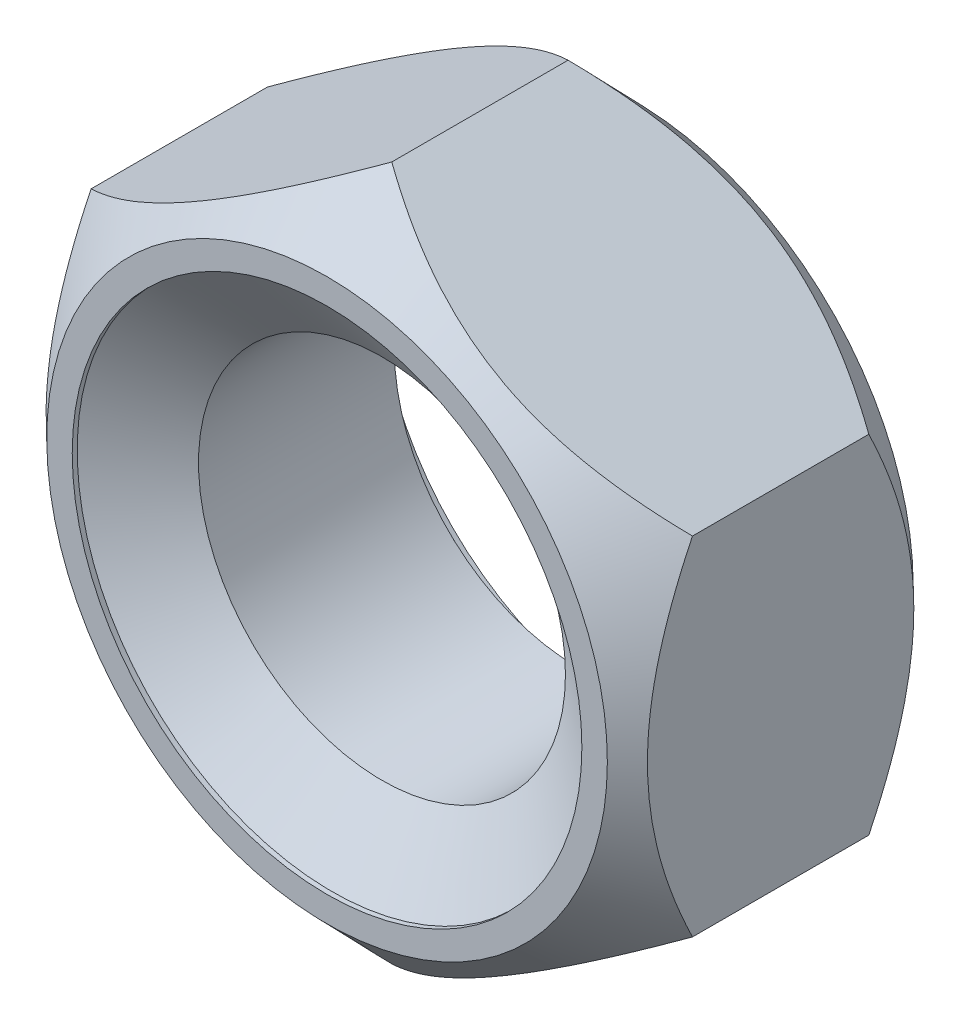
ISO-10303-21;
HEADER;
FILE_DESCRIPTION(('STEP AP214'),'2;1');
FILE_NAME('part.step','',(''),(''),'','','');
FILE_SCHEMA(('AUTOMOTIVE_DESIGN { 1 0 10303 214 1 1 1 1 }'));
ENDSEC;
DATA;
#1=APPLICATION_CONTEXT('core data for automotive mechanical design processes');
#2=APPLICATION_PROTOCOL_DEFINITION('international standard','automotive_design',2000,#1);
#3=PRODUCT_CONTEXT('',#1,'mechanical');
#4=PRODUCT('Part','Part','',(#3));
#5=PRODUCT_RELATED_PRODUCT_CATEGORY('part','',(#4));
#6=PRODUCT_DEFINITION_FORMATION('','',#4);
#7=PRODUCT_DEFINITION_CONTEXT('part definition',#1,'design');
#8=PRODUCT_DEFINITION('design','',#6,#7);
#9=PRODUCT_DEFINITION_SHAPE('','',#8);
#10=(LENGTH_UNIT() NAMED_UNIT(*) SI_UNIT(.MILLI.,.METRE.));
#11=(NAMED_UNIT(*) PLANE_ANGLE_UNIT() SI_UNIT($,.RADIAN.));
#12=(NAMED_UNIT(*) SI_UNIT($,.STERADIAN.) SOLID_ANGLE_UNIT());
#13=UNCERTAINTY_MEASURE_WITH_UNIT(LENGTH_MEASURE(1.E-05),#10,'distance_accuracy_value','');
#14=(GEOMETRIC_REPRESENTATION_CONTEXT(3) GLOBAL_UNCERTAINTY_ASSIGNED_CONTEXT((#13)) GLOBAL_UNIT_ASSIGNED_CONTEXT((#10,
#11,#12)) REPRESENTATION_CONTEXT('',''));
#15=CARTESIAN_POINT('',(0.,0.,0.));
#16=DIRECTION('',(0.,0.,1.));
#17=DIRECTION('',(1.,0.,0.));
#18=AXIS2_PLACEMENT_3D('',#15,#16,#17);
#19=CARTESIAN_POINT('',(0.,0.,-3.));
#20=DIRECTION('',(0.,0.,1.));
#21=DIRECTION('',(1.,0.,0.));
#22=AXIS2_PLACEMENT_3D('',#19,#20,#21);
#23=CYLINDRICAL_SURFACE('',#22,1.8);
#24=CARTESIAN_POINT('',(0.,0.,-0.538945276746799));
#25=DIRECTION('',(0.,0.,1.));
#26=DIRECTION('',(1.,0.,0.));
#27=AXIS2_PLACEMENT_3D('',#24,#25,#26);
#28=CIRCLE('',#27,1.8);
#29=CARTESIAN_POINT('',(1.8,0.,-0.538945276746799));
#30=VERTEX_POINT('',#29);
#31=EDGE_CURVE('E126',#30,#30,#28,.F.);
#32=ORIENTED_EDGE('',*,*,#31,.F.);
#33=EDGE_LOOP('',(#32));
#34=FACE_BOUND('',#33,.T.);
#35=CARTESIAN_POINT('',(0.,0.,-2.4600547232532));
#36=DIRECTION('',(0.,0.,-1.));
#37=DIRECTION('',(-1.,0.,0.));
#38=AXIS2_PLACEMENT_3D('',#35,#36,#37);
#39=CIRCLE('',#38,1.8);
#40=CARTESIAN_POINT('',(-1.8,0.,-2.4600547232532));
#41=VERTEX_POINT('',#40);
#42=EDGE_CURVE('E42',#41,#41,#39,.F.);
#43=ORIENTED_EDGE('',*,*,#42,.F.);
#44=EDGE_LOOP('',(#43));
#45=FACE_BOUND('',#44,.T.);
#46=ADVANCED_FACE('F37',(#34,#45),#23,.F.);
#47=CARTESIAN_POINT('',(0.,3.40636658821879,-3.));
#48=DIRECTION('',(-0.500000000000001,0.866025403784438,0.));
#49=DIRECTION('',(-0.866025403784438,-0.500000000000001,0.));
#50=AXIS2_PLACEMENT_3D('',#47,#48,#49);
#51=PLANE('',#50);
#52=DIRECTION('',(0.,0.,1.));
#53=VECTOR('',#52,1.);
#54=CARTESIAN_POINT('',(-2.95,1.7031832941094,-3.));
#55=LINE('',#54,#53);
#56=CARTESIAN_POINT('',(-2.95,1.7031832941094,-2.365));
#57=VERTEX_POINT('',#56);
#58=CARTESIAN_POINT('',(-2.95,1.7031832941094,-0.634999999999997));
#59=VERTEX_POINT('',#58);
#60=EDGE_CURVE('E122',#57,#59,#55,.T.);
#61=ORIENTED_EDGE('',*,*,#60,.T.);
#62=CARTESIAN_POINT('',(-2.9502,1.70306782405556,-0.635111716857146));
#63=CARTESIAN_POINT('',(-2.84583872769302,1.76332083271496,-0.57686655771487));
#64=CARTESIAN_POINT('',(-2.73976408829107,1.82456305432787,-0.522197546683607));
#65=CARTESIAN_POINT('',(-2.52358611847778,1.94937346339244,-0.422544383341783));
#66=CARTESIAN_POINT('',(-2.4134632708528,2.01295291911265,-0.377617211068043));
#67=CARTESIAN_POINT('',(-2.19160945194076,2.14104028118227,-0.301339179519592));
#68=CARTESIAN_POINT('',(-2.07993439790485,2.20551590369167,-0.269777925383963));
#69=CARTESIAN_POINT('',(-1.85433112246877,2.33576801549475,-0.222139346920104));
#70=CARTESIAN_POINT('',(-1.74040917865703,2.40154088042106,-0.206023800796524));
#71=CARTESIAN_POINT('',(-1.54243085672819,2.51584371788039,-0.19295258841599));
#72=CARTESIAN_POINT('',(-1.45856189675353,2.56426548449841,-0.192016506165866));
#73=CARTESIAN_POINT('',(-1.29109135354176,2.66095464770306,-0.199348496066585));
#74=CARTESIAN_POINT('',(-1.20748988949907,2.70922197547275,-0.207620217655345));
#75=CARTESIAN_POINT('',(-1.04120315064151,2.80522766891483,-0.232872868581427));
#76=CARTESIAN_POINT('',(-0.958518997753552,2.85296538684241,-0.249863470339106));
#77=CARTESIAN_POINT('',(-0.794669809957637,2.94756375952288,-0.291604361823323));
#78=CARTESIAN_POINT('',(-0.71350462731244,2.99442449957191,-0.316353892704923));
#79=CARTESIAN_POINT('',(-0.524167500400833,3.10373834076192,-0.382542442377068));
#80=CARTESIAN_POINT('',(-0.416731485981638,3.1657665526075,-0.426784236029786));
#81=CARTESIAN_POINT('',(-0.258313938353182,3.25722896637515,-0.500156892653814));
#82=CARTESIAN_POINT('',(-0.206052118368694,3.28740234221154,-0.525732568432492));
#83=CARTESIAN_POINT('',(-0.102336569641856,3.34728254218813,-0.578945213705387));
#84=CARTESIAN_POINT('',(-0.0508826306745627,3.37698948770176,-0.60658163582312));
#85=CARTESIAN_POINT('',(0.000200000000000844,3.40648205827263,-0.635111716857149));
#86=B_SPLINE_CURVE_WITH_KNOTS('',3,(#62,#63,#64,#65,#66,#67,#68,#69,#70,#71,#72,#73,#74,#75,#76,
#77,#78,#79,#80,#81,#82,#83,#84,#85),.UNSPECIFIED.,.F.,.F.,(4,2,2,2,2,2,2,2,2,2,2,4),(0.,
0.401814846875242,0.805920044066735,1.20340369413398,1.59990117594797,1.8900223044514,
2.18025846105081,2.4708172937885,2.76134771792165,3.15590573924836,3.35250653924817,
3.54905530280174),.UNSPECIFIED.);
#87=CARTESIAN_POINT('',(0.,3.40636658821879,-0.635));
#88=VERTEX_POINT('',#87);
#89=EDGE_CURVE('E55',#59,#88,#86,.T.);
#90=ORIENTED_EDGE('',*,*,#89,.T.);
#91=DIRECTION('',(0.,0.,1.));
#92=VECTOR('',#91,1.);
#93=CARTESIAN_POINT('',(0.,3.40636658821879,-3.));
#94=LINE('',#93,#92);
#95=CARTESIAN_POINT('',(0.,3.4063665882188,-2.365));
#96=VERTEX_POINT('',#95);
#97=EDGE_CURVE('E11',#96,#88,#94,.T.);
#98=ORIENTED_EDGE('',*,*,#97,.F.);
#99=CARTESIAN_POINT('',(-2.9502,1.70306782405556,-2.36488828314285));
#100=CARTESIAN_POINT('',(-2.84583872769302,1.76332083271496,-2.42313344228513));
#101=CARTESIAN_POINT('',(-2.73976408829107,1.82456305432787,-2.47780245331639));
#102=CARTESIAN_POINT('',(-2.52358611847778,1.94937346339244,-2.57745561665822));
#103=CARTESIAN_POINT('',(-2.4134632708528,2.01295291911265,-2.62238278893196));
#104=CARTESIAN_POINT('',(-2.19160945194075,2.14104028118227,-2.69866082048041));
#105=CARTESIAN_POINT('',(-2.07993439790485,2.20551590369167,-2.73022207461604));
#106=CARTESIAN_POINT('',(-1.85433112246877,2.33576801549475,-2.7778606530799));
#107=CARTESIAN_POINT('',(-1.74040917865703,2.40154088042106,-2.79397619920348));
#108=CARTESIAN_POINT('',(-1.54243085672819,2.51584371788039,-2.80704741158401));
#109=CARTESIAN_POINT('',(-1.45856189675353,2.56426548449841,-2.80798349383413));
#110=CARTESIAN_POINT('',(-1.29109135354176,2.66095464770306,-2.80065150393341));
#111=CARTESIAN_POINT('',(-1.20748988949907,2.70922197547275,-2.79237978234465));
#112=CARTESIAN_POINT('',(-1.04120315064151,2.80522766891483,-2.76712713141857));
#113=CARTESIAN_POINT('',(-0.958518997753551,2.85296538684241,-2.75013652966089));
#114=CARTESIAN_POINT('',(-0.794669809957637,2.94756375952288,-2.70839563817668));
#115=CARTESIAN_POINT('',(-0.713504627312439,2.99442449957191,-2.68364610729508));
#116=CARTESIAN_POINT('',(-0.524167500400833,3.10373834076192,-2.61745755762293));
#117=CARTESIAN_POINT('',(-0.416731485981637,3.1657665526075,-2.57321576397021));
#118=CARTESIAN_POINT('',(-0.258313938353181,3.25722896637515,-2.49984310734619));
#119=CARTESIAN_POINT('',(-0.206052118368694,3.28740234221154,-2.47426743156751));
#120=CARTESIAN_POINT('',(-0.102336569641856,3.34728254218813,-2.42105478629461));
#121=CARTESIAN_POINT('',(-0.0508826306745626,3.37698948770176,-2.39341836417688));
#122=CARTESIAN_POINT('',(0.000200000000000917,3.40648205827263,-2.36488828314285));
#123=B_SPLINE_CURVE_WITH_KNOTS('',3,(#99,#100,#101,#102,#103,#104,#105,#106,#107,#108,#109,#110,
#111,#112,#113,#114,#115,#116,#117,#118,#119,#120,#121,#122),.UNSPECIFIED.,.F.,.F.,(4,2,2,2,2,2,
2,2,2,2,2,4),(0.,0.401814846875242,0.805920044066735,1.20340369413398,1.59990117594797,
1.8900223044514,2.18025846105081,2.4708172937885,2.76134771792165,3.15590573924836,
3.35250653924817,3.54905530280174),.UNSPECIFIED.);
#124=EDGE_CURVE('E125',#57,#96,#123,.T.);
#125=ORIENTED_EDGE('',*,*,#124,.F.);
#126=EDGE_LOOP('',(#61,#90,#98,#125));
#127=FACE_BOUND('',#126,.T.);
#128=ADVANCED_FACE('F39',(#127),#51,.T.);
#129=CARTESIAN_POINT('',(2.95,1.70318329410939,-3.));
#130=DIRECTION('',(0.500000000000001,0.866025403784438,0.));
#131=DIRECTION('',(-0.866025403784438,0.500000000000001,0.));
#132=AXIS2_PLACEMENT_3D('',#129,#130,#131);
#133=PLANE('',#132);
#134=ORIENTED_EDGE('',*,*,#97,.T.);
#135=CARTESIAN_POINT('',(-0.000199999999999191,3.40648205827263,-0.635111716857149));
#136=CARTESIAN_POINT('',(0.104161272306981,3.34622904961323,-0.576866557714873));
#137=CARTESIAN_POINT('',(0.21023591170893,3.28498682800032,-0.52219754668361));
#138=CARTESIAN_POINT('',(0.42641388152222,3.16017641893575,-0.422544383341784));
#139=CARTESIAN_POINT('',(0.536536729147199,3.09659696321554,-0.377617211068043));
#140=CARTESIAN_POINT('',(0.758390548059249,2.96850960114592,-0.301339179519592));
#141=CARTESIAN_POINT('',(0.870065602095158,2.90403397863652,-0.269777925383964));
#142=CARTESIAN_POINT('',(1.09566887753124,2.77378186683344,-0.222139346920104));
#143=CARTESIAN_POINT('',(1.20959082134298,2.70800900190712,-0.206023800796523));
#144=CARTESIAN_POINT('',(1.40756914327182,2.5937061644478,-0.192952588415989));
#145=CARTESIAN_POINT('',(1.49143810324647,2.54528439782978,-0.192016506165866));
#146=CARTESIAN_POINT('',(1.65890864645825,2.44859523462513,-0.199348496066585));
#147=CARTESIAN_POINT('',(1.74251011050093,2.40032790685543,-0.207620217655345));
#148=CARTESIAN_POINT('',(1.9087968493585,2.30432221341335,-0.232872868581426));
#149=CARTESIAN_POINT('',(1.99148100224645,2.25658449548578,-0.249863470339105));
#150=CARTESIAN_POINT('',(2.15533019004237,2.1619861228053,-0.291604361823322));
#151=CARTESIAN_POINT('',(2.23649537268757,2.11512538275627,-0.316353892704922));
#152=CARTESIAN_POINT('',(2.42583249959917,2.00581154156627,-0.382542442377066));
#153=CARTESIAN_POINT('',(2.53326851401837,1.94378332972068,-0.426784236029784));
#154=CARTESIAN_POINT('',(2.69168606164682,1.85232091595303,-0.500156892653812));
#155=CARTESIAN_POINT('',(2.74394788163131,1.82214754011665,-0.525732568432489));
#156=CARTESIAN_POINT('',(2.84766343035814,1.76226734014006,-0.578945213705384));
#157=CARTESIAN_POINT('',(2.89911736932544,1.73256039462643,-0.606581635823117));
#158=CARTESIAN_POINT('',(2.9502,1.70306782405556,-0.635111716857145));
#159=B_SPLINE_CURVE_WITH_KNOTS('',3,(#135,#136,#137,#138,#139,#140,#141,#142,#143,#144,#145,
#146,#147,#148,#149,#150,#151,#152,#153,#154,#155,#156,#157,#158),.UNSPECIFIED.,.F.,.F.,(4,2,2,
2,2,2,2,2,2,2,2,4),(0.,0.401814846875244,0.805920044066738,1.20340369413398,1.59990117594797,
1.89002230445141,2.18025846105082,2.4708172937885,2.76134771792166,3.15590573924836,
3.35250653924817,3.54905530280173),.UNSPECIFIED.);
#160=CARTESIAN_POINT('',(2.95,1.7031832941094,-0.635));
#161=VERTEX_POINT('',#160);
#162=EDGE_CURVE('E94',#88,#161,#159,.T.);
#163=ORIENTED_EDGE('',*,*,#162,.T.);
#164=DIRECTION('',(0.,0.,1.));
#165=VECTOR('',#164,1.);
#166=CARTESIAN_POINT('',(2.95,1.70318329410939,-3.));
#167=LINE('',#166,#165);
#168=CARTESIAN_POINT('',(2.95,1.7031832941094,-2.365));
#169=VERTEX_POINT('',#168);
#170=EDGE_CURVE('E47',#169,#161,#167,.T.);
#171=ORIENTED_EDGE('',*,*,#170,.F.);
#172=CARTESIAN_POINT('',(-0.000199999999999191,3.40648205827263,-2.36488828314285));
#173=CARTESIAN_POINT('',(0.104161272306981,3.34622904961323,-2.42313344228513));
#174=CARTESIAN_POINT('',(0.21023591170893,3.28498682800032,-2.47780245331639));
#175=CARTESIAN_POINT('',(0.42641388152222,3.16017641893575,-2.57745561665822));
#176=CARTESIAN_POINT('',(0.536536729147198,3.09659696321554,-2.62238278893196));
#177=CARTESIAN_POINT('',(0.758390548059248,2.96850960114592,-2.69866082048041));
#178=CARTESIAN_POINT('',(0.870065602095157,2.90403397863652,-2.73022207461604));
#179=CARTESIAN_POINT('',(1.09566887753124,2.77378186683344,-2.7778606530799));
#180=CARTESIAN_POINT('',(1.20959082134298,2.70800900190712,-2.79397619920348));
#181=CARTESIAN_POINT('',(1.40756914327182,2.5937061644478,-2.80704741158401));
#182=CARTESIAN_POINT('',(1.49143810324647,2.54528439782978,-2.80798349383413));
#183=CARTESIAN_POINT('',(1.65890864645825,2.44859523462513,-2.80065150393342));
#184=CARTESIAN_POINT('',(1.74251011050093,2.40032790685543,-2.79237978234465));
#185=CARTESIAN_POINT('',(1.90879684935849,2.30432221341336,-2.76712713141857));
#186=CARTESIAN_POINT('',(1.99148100224645,2.25658449548578,-2.7501365296609));
#187=CARTESIAN_POINT('',(2.15533019004237,2.1619861228053,-2.70839563817668));
#188=CARTESIAN_POINT('',(2.23649537268756,2.11512538275627,-2.68364610729508));
#189=CARTESIAN_POINT('',(2.42583249959917,2.00581154156627,-2.61745755762293));
#190=CARTESIAN_POINT('',(2.53326851401837,1.94378332972068,-2.57321576397022));
#191=CARTESIAN_POINT('',(2.69168606164682,1.85232091595303,-2.49984310734619));
#192=CARTESIAN_POINT('',(2.74394788163131,1.82214754011665,-2.47426743156751));
#193=CARTESIAN_POINT('',(2.84766343035814,1.76226734014006,-2.42105478629462));
#194=CARTESIAN_POINT('',(2.89911736932544,1.73256039462643,-2.39341836417688));
#195=CARTESIAN_POINT('',(2.9502,1.70306782405556,-2.36488828314285));
#196=B_SPLINE_CURVE_WITH_KNOTS('',3,(#172,#173,#174,#175,#176,#177,#178,#179,#180,#181,#182,
#183,#184,#185,#186,#187,#188,#189,#190,#191,#192,#193,#194,#195),.UNSPECIFIED.,.F.,.F.,(4,2,2,
2,2,2,2,2,2,2,2,4),(0.,0.401814846875243,0.805920044066738,1.20340369413398,1.59990117594797,
1.8900223044514,2.18025846105082,2.4708172937885,2.76134771792166,3.15590573924836,
3.35250653924817,3.54905530280174),.UNSPECIFIED.);
#197=EDGE_CURVE('E202',#96,#169,#196,.T.);
#198=ORIENTED_EDGE('',*,*,#197,.F.);
#199=EDGE_LOOP('',(#134,#163,#171,#198));
#200=FACE_BOUND('',#199,.T.);
#201=ADVANCED_FACE('F104',(#200),#133,.T.);
#202=CARTESIAN_POINT('',(2.95,1.70318329410939,-3.));
#203=DIRECTION('',(-1.,0.,0.));
#204=DIRECTION('',(0.,0.,1.));
#205=AXIS2_PLACEMENT_3D('',#202,#203,#204);
#206=PLANE('',#205);
#207=CARTESIAN_POINT('',(2.95,-3.5221365898877,-1.78430005727422));
#208=CARTESIAN_POINT('',(2.95,-3.43587033910626,-1.72033359307285));
#209=CARTESIAN_POINT('',(2.95,-3.349149236759,-1.65697068507001));
#210=CARTESIAN_POINT('',(2.95,-3.17461277794552,-1.53172721095207));
#211=CARTESIAN_POINT('',(2.95,-3.08679716386917,-1.46984700422613));
#212=CARTESIAN_POINT('',(2.95,-2.90925747071061,-1.3474124728311));
#213=CARTESIAN_POINT('',(2.95,-2.81952396728176,-1.28687176849215));
#214=CARTESIAN_POINT('',(2.95,-2.6386032376885,-1.1680101657043));
#215=CARTESIAN_POINT('',(2.95,-2.54741611142294,-1.10968911563694));
#216=CARTESIAN_POINT('',(2.95,-2.35797299408191,-0.99244093891961));
#217=CARTESIAN_POINT('',(2.95,-2.25961523202614,-0.933677414148763));
#218=CARTESIAN_POINT('',(2.95,-2.06068037282783,-0.819972588792626));
#219=CARTESIAN_POINT('',(2.95,-1.96010292787628,-0.765031892900306));
#220=CARTESIAN_POINT('',(2.95,-1.75672610296955,-0.660162705636095));
#221=CARTESIAN_POINT('',(2.95,-1.65393420372363,-0.61021982198677));
#222=CARTESIAN_POINT('',(2.95,-1.4456048049448,-0.516487220784965));
#223=CARTESIAN_POINT('',(2.95,-1.3400685616046,-0.472694744728468));
#224=CARTESIAN_POINT('',(2.95,-1.13396035723193,-0.395797683714285));
#225=CARTESIAN_POINT('',(2.95,-1.03359582736312,-0.362143244915821));
#226=CARTESIAN_POINT('',(2.95,-0.830459188561695,-0.302941103355644));
#227=CARTESIAN_POINT('',(2.95,-0.727686965149399,-0.27739378691038));
#228=CARTESIAN_POINT('',(2.95,-0.522112775306069,-0.236243217870842));
#229=CARTESIAN_POINT('',(2.95,-0.41934646698147,-0.220464898563067));
#230=CARTESIAN_POINT('',(2.95,-0.212749886595254,-0.199178089522989));
#231=CARTESIAN_POINT('',(2.95,-0.108919810558603,-0.193667740715288));
#232=CARTESIAN_POINT('',(2.95,0.0940189562109803,-0.193327538885309));
#233=CARTESIAN_POINT('',(2.95,0.193127131023347,-0.198022304156028));
#234=CARTESIAN_POINT('',(2.95,0.390442168539001,-0.216809553558798));
#235=CARTESIAN_POINT('',(2.95,0.48864894116339,-0.23090296677049));
#236=CARTESIAN_POINT('',(2.95,0.685195343734785,-0.267950080977284));
#237=CARTESIAN_POINT('',(2.95,0.783505067315902,-0.29105987127681));
#238=CARTESIAN_POINT('',(2.95,0.977977375538684,-0.344880636655155));
#239=CARTESIAN_POINT('',(2.95,1.07414015554236,-0.375590917025566));
#240=CARTESIAN_POINT('',(2.95,1.27846819662874,-0.448421519702279));
#241=CARTESIAN_POINT('',(2.95,1.38626610416787,-0.491562894363634));
#242=CARTESIAN_POINT('',(2.95,1.59899240822777,-0.584474247740642));
#243=CARTESIAN_POINT('',(2.95,1.70391928049084,-0.634247668208262));
#244=CARTESIAN_POINT('',(2.95,1.91148495640677,-0.73916015995759));
#245=CARTESIAN_POINT('',(2.95,2.01411467866161,-0.794317047952299));
#246=CARTESIAN_POINT('',(2.95,2.21702807343491,-0.90872104476242));
#247=CARTESIAN_POINT('',(2.95,2.31731216383558,-0.967967417476055));
#248=CARTESIAN_POINT('',(2.95,2.51047854307288,-1.08639352045413));
#249=CARTESIAN_POINT('',(2.95,2.60346669358919,-1.14540150909503));
#250=CARTESIAN_POINT('',(2.95,2.78791111422012,-1.26577285181248));
#251=CARTESIAN_POINT('',(2.95,2.87936726693234,-1.32713638522737));
#252=CARTESIAN_POINT('',(2.95,3.06018616048284,-1.45125118012356));
#253=CARTESIAN_POINT('',(2.95,3.1495600908906,-1.513986197601));
#254=CARTESIAN_POINT('',(2.95,3.32716030996719,-1.64101286197741));
#255=CARTESIAN_POINT('',(2.95,3.41538689641657,-1.70530409206257));
#256=CARTESIAN_POINT('',(2.95,3.50313895787466,-1.77022580783664));
#257=B_SPLINE_CURVE_WITH_KNOTS('',3,(#207,#208,#209,#210,#211,#212,#213,#214,#215,#216,#217,
#218,#219,#220,#221,#222,#223,#224,#225,#226,#227,#228,#229,#230,#231,#232,#233,#234,#235,#236,
#237,#238,#239,#240,#241,#242,#243,#244,#245,#246,#247,#248,#249,#250,#251,#252,#253,#254,#255,
#256),.UNSPECIFIED.,.F.,.F.,(4,2,2,2,2,2,2,2,2,2,2,2,2,2,2,2,2,2,2,2,2,2,2,2,4),(0.,
0.322189522057415,0.644456364788337,0.969168086589207,1.29385758827532,1.6375136289945,
1.98122390603945,2.32391404890438,2.66644999844503,2.98373915310076,3.30104342478752,
3.61248302901431,3.92386623981998,4.22105621658704,4.5182755756754,4.82088653868438,
5.12346985231976,5.47151354257321,5.8197385614531,6.16915786115488,6.51851442904261,
6.84886404866466,7.17923886938407,7.50680349302979,7.83428133235895),.UNSPECIFIED.);
#258=CARTESIAN_POINT('',(2.95,-1.7031832941094,-0.635));
#259=VERTEX_POINT('',#258);
#260=EDGE_CURVE('E91',#259,#161,#257,.T.);
#261=ORIENTED_EDGE('',*,*,#260,.F.);
#262=DIRECTION('',(0.,0.,1.));
#263=VECTOR('',#262,1.);
#264=CARTESIAN_POINT('',(2.95,-1.7031832941094,-3.));
#265=LINE('',#264,#263);
#266=CARTESIAN_POINT('',(2.95,-1.7031832941094,-2.365));
#267=VERTEX_POINT('',#266);
#268=EDGE_CURVE('E111',#267,#259,#265,.T.);
#269=ORIENTED_EDGE('',*,*,#268,.F.);
#270=CARTESIAN_POINT('',(2.95,-3.5221365898877,-1.21569994272578));
#271=CARTESIAN_POINT('',(2.95,-3.43587033910627,-1.27966640692715));
#272=CARTESIAN_POINT('',(2.95,-3.349149236759,-1.34302931492999));
#273=CARTESIAN_POINT('',(2.95,-3.17461277794552,-1.46827278904793));
#274=CARTESIAN_POINT('',(2.95,-3.08679716386917,-1.53015299577387));
#275=CARTESIAN_POINT('',(2.95,-2.90925747071061,-1.6525875271689));
#276=CARTESIAN_POINT('',(2.95,-2.81952396728176,-1.71312823150785));
#277=CARTESIAN_POINT('',(2.95,-2.6386032376885,-1.8319898342957));
#278=CARTESIAN_POINT('',(2.95,-2.54741611142294,-1.89031088436306));
#279=CARTESIAN_POINT('',(2.95,-2.35797299408192,-2.00755906108039));
#280=CARTESIAN_POINT('',(2.95,-2.25961523202614,-2.06632258585124));
#281=CARTESIAN_POINT('',(2.95,-2.06068037282783,-2.18002741120737));
#282=CARTESIAN_POINT('',(2.95,-1.96010292787628,-2.23496810709969));
#283=CARTESIAN_POINT('',(2.95,-1.75672610296955,-2.3398372943639));
#284=CARTESIAN_POINT('',(2.95,-1.65393420372363,-2.38978017801323));
#285=CARTESIAN_POINT('',(2.95,-1.4456048049448,-2.48351277921503));
#286=CARTESIAN_POINT('',(2.95,-1.3400685616046,-2.52730525527153));
#287=CARTESIAN_POINT('',(2.95,-1.13396035723193,-2.60420231628571));
#288=CARTESIAN_POINT('',(2.95,-1.03359582736312,-2.63785675508418));
#289=CARTESIAN_POINT('',(2.95,-0.830459188561695,-2.69705889664436));
#290=CARTESIAN_POINT('',(2.95,-0.727686965149399,-2.72260621308962));
#291=CARTESIAN_POINT('',(2.95,-0.522112775306068,-2.76375678212916));
#292=CARTESIAN_POINT('',(2.95,-0.419346466981469,-2.77953510143693));
#293=CARTESIAN_POINT('',(2.95,-0.212749886595254,-2.80082191047701));
#294=CARTESIAN_POINT('',(2.95,-0.108919810558602,-2.80633225928471));
#295=CARTESIAN_POINT('',(2.95,0.0940189562109805,-2.80667246111469));
#296=CARTESIAN_POINT('',(2.95,0.193127131023347,-2.80197769584397));
#297=CARTESIAN_POINT('',(2.95,0.390442168539001,-2.7831904464412));
#298=CARTESIAN_POINT('',(2.95,0.48864894116339,-2.76909703322951));
#299=CARTESIAN_POINT('',(2.95,0.685195343734785,-2.73204991902272));
#300=CARTESIAN_POINT('',(2.95,0.783505067315902,-2.70894012872319));
#301=CARTESIAN_POINT('',(2.95,0.977977375538684,-2.65511936334484));
#302=CARTESIAN_POINT('',(2.95,1.07414015554236,-2.62440908297443));
#303=CARTESIAN_POINT('',(2.95,1.27846819662874,-2.55157848029772));
#304=CARTESIAN_POINT('',(2.95,1.38626610416787,-2.50843710563637));
#305=CARTESIAN_POINT('',(2.95,1.59899240822777,-2.41552575225936));
#306=CARTESIAN_POINT('',(2.95,1.70391928049084,-2.36575233179174));
#307=CARTESIAN_POINT('',(2.95,1.91148495640677,-2.26083984004241));
#308=CARTESIAN_POINT('',(2.95,2.01411467866161,-2.2056829520477));
#309=CARTESIAN_POINT('',(2.95,2.21702807343491,-2.09127895523758));
#310=CARTESIAN_POINT('',(2.95,2.31731216383558,-2.03203258252395));
#311=CARTESIAN_POINT('',(2.95,2.51047854307288,-1.91360647954587));
#312=CARTESIAN_POINT('',(2.95,2.60346669358919,-1.85459849090497));
#313=CARTESIAN_POINT('',(2.95,2.78791111422012,-1.73422714818752));
#314=CARTESIAN_POINT('',(2.95,2.87936726693234,-1.67286361477263));
#315=CARTESIAN_POINT('',(2.95,3.06018616048284,-1.54874881987644));
#316=CARTESIAN_POINT('',(2.95,3.1495600908906,-1.486013802399));
#317=CARTESIAN_POINT('',(2.95,3.32716030996719,-1.35898713802259));
#318=CARTESIAN_POINT('',(2.95,3.41538689641657,-1.29469590793743));
#319=CARTESIAN_POINT('',(2.95,3.50313895787466,-1.22977419216336));
#320=B_SPLINE_CURVE_WITH_KNOTS('',3,(#270,#271,#272,#273,#274,#275,#276,#277,#278,#279,#280,
#281,#282,#283,#284,#285,#286,#287,#288,#289,#290,#291,#292,#293,#294,#295,#296,#297,#298,#299,
#300,#301,#302,#303,#304,#305,#306,#307,#308,#309,#310,#311,#312,#313,#314,#315,#316,#317,#318,
#319),.UNSPECIFIED.,.F.,.F.,(4,2,2,2,2,2,2,2,2,2,2,2,2,2,2,2,2,2,2,2,2,2,2,2,4),(0.,
0.322189522057415,0.644456364788337,0.969168086589206,1.29385758827532,1.6375136289945,
1.98122390603945,2.32391404890438,2.66644999844503,2.98373915310076,3.30104342478752,
3.61248302901431,3.92386623981998,4.22105621658704,4.5182755756754,4.82088653868437,
5.12346985231976,5.47151354257321,5.8197385614531,6.16915786115488,6.51851442904261,
6.84886404866466,7.17923886938407,7.50680349302979,7.83428133235895),.UNSPECIFIED.);
#321=EDGE_CURVE('E110',#267,#169,#320,.T.);
#322=ORIENTED_EDGE('',*,*,#321,.T.);
#323=ORIENTED_EDGE('',*,*,#170,.T.);
#324=EDGE_LOOP('',(#261,#269,#322,#323));
#325=FACE_BOUND('',#324,.T.);
#326=ADVANCED_FACE('F109',(#325),#206,.F.);
#327=CARTESIAN_POINT('',(0.,-3.4063665882188,-3.));
#328=DIRECTION('',(0.500000000000001,-0.866025403784438,0.));
#329=DIRECTION('',(0.866025403784438,0.500000000000001,0.));
#330=AXIS2_PLACEMENT_3D('',#327,#328,#329);
#331=PLANE('',#330);
#332=ORIENTED_EDGE('',*,*,#268,.T.);
#333=CARTESIAN_POINT('',(2.9502,-1.70306782405556,-0.635111716857149));
#334=CARTESIAN_POINT('',(2.84583872769302,-1.76332083271497,-0.576866557714874));
#335=CARTESIAN_POINT('',(2.73976408829107,-1.82456305432788,-0.522197546683611));
#336=CARTESIAN_POINT('',(2.52358611847778,-1.94937346339245,-0.422544383341787));
#337=CARTESIAN_POINT('',(2.4134632708528,-2.01295291911266,-0.377617211068047));
#338=CARTESIAN_POINT('',(2.19160945194076,-2.14104028118228,-0.301339179519597));
#339=CARTESIAN_POINT('',(2.07993439790485,-2.20551590369167,-0.269777925383968));
#340=CARTESIAN_POINT('',(1.85433112246877,-2.33576801549476,-0.222139346920109));
#341=CARTESIAN_POINT('',(1.74040917865703,-2.40154088042107,-0.206023800796529));
#342=CARTESIAN_POINT('',(1.54243085672819,-2.51584371788039,-0.192952588415995));
#343=CARTESIAN_POINT('',(1.45856189675353,-2.56426548449842,-0.192016506165872));
#344=CARTESIAN_POINT('',(1.29109135354176,-2.66095464770307,-0.19934849606659));
#345=CARTESIAN_POINT('',(1.20748988949907,-2.70922197547276,-0.207620217655351));
#346=CARTESIAN_POINT('',(1.04120315064151,-2.80522766891484,-0.232872868581432));
#347=CARTESIAN_POINT('',(0.958518997753552,-2.85296538684242,-0.249863470339112));
#348=CARTESIAN_POINT('',(0.794669809957637,-2.94756375952289,-0.291604361823329));
#349=CARTESIAN_POINT('',(0.71350462731244,-2.99442449957192,-0.316353892704929));
#350=CARTESIAN_POINT('',(0.524167500400833,-3.10373834076193,-0.382542442377074));
#351=CARTESIAN_POINT('',(0.416731485981637,-3.16576655260751,-0.426784236029792));
#352=CARTESIAN_POINT('',(0.258313938353182,-3.25722896637516,-0.50015689265382));
#353=CARTESIAN_POINT('',(0.206052118368694,-3.28740234221154,-0.525732568432498));
#354=CARTESIAN_POINT('',(0.102336569641856,-3.34728254218813,-0.578945213705393));
#355=CARTESIAN_POINT('',(0.0508826306745628,-3.37698948770177,-0.606581635823126));
#356=CARTESIAN_POINT('',(-0.000200000000000567,-3.40648205827264,-0.635111716857155));
#357=B_SPLINE_CURVE_WITH_KNOTS('',3,(#333,#334,#335,#336,#337,#338,#339,#340,#341,#342,#343,
#344,#345,#346,#347,#348,#349,#350,#351,#352,#353,#354,#355,#356),.UNSPECIFIED.,.F.,.F.,(4,2,2,
2,2,2,2,2,2,2,2,4),(0.,0.401814846875242,0.805920044066734,1.20340369413398,1.59990117594796,
1.8900223044514,2.18025846105081,2.4708172937885,2.76134771792165,3.15590573924836,
3.35250653924817,3.54905530280173),.UNSPECIFIED.);
#358=CARTESIAN_POINT('',(0.,-3.4063665882188,-0.635));
#359=VERTEX_POINT('',#358);
#360=EDGE_CURVE('E96',#259,#359,#357,.T.);
#361=ORIENTED_EDGE('',*,*,#360,.T.);
#362=DIRECTION('',(0.,0.,1.));
#363=VECTOR('',#362,1.);
#364=CARTESIAN_POINT('',(0.,-3.4063665882188,-3.));
#365=LINE('',#364,#363);
#366=CARTESIAN_POINT('',(0.,-3.4063665882188,-2.365));
#367=VERTEX_POINT('',#366);
#368=EDGE_CURVE('E113',#367,#359,#365,.T.);
#369=ORIENTED_EDGE('',*,*,#368,.F.);
#370=CARTESIAN_POINT('',(2.9502,-1.70306782405556,-2.36488828314285));
#371=CARTESIAN_POINT('',(2.84583872769302,-1.76332083271497,-2.42313344228513));
#372=CARTESIAN_POINT('',(2.73976408829107,-1.82456305432788,-2.47780245331639));
#373=CARTESIAN_POINT('',(2.52358611847778,-1.94937346339245,-2.57745561665821));
#374=CARTESIAN_POINT('',(2.4134632708528,-2.01295291911266,-2.62238278893195));
#375=CARTESIAN_POINT('',(2.19160945194076,-2.14104028118228,-2.6986608204804));
#376=CARTESIAN_POINT('',(2.07993439790485,-2.20551590369167,-2.73022207461603));
#377=CARTESIAN_POINT('',(1.85433112246877,-2.33576801549476,-2.77786065307989));
#378=CARTESIAN_POINT('',(1.74040917865703,-2.40154088042107,-2.79397619920347));
#379=CARTESIAN_POINT('',(1.54243085672819,-2.51584371788039,-2.80704741158401));
#380=CARTESIAN_POINT('',(1.45856189675353,-2.56426548449842,-2.80798349383413));
#381=CARTESIAN_POINT('',(1.29109135354176,-2.66095464770307,-2.80065150393341));
#382=CARTESIAN_POINT('',(1.20748988949907,-2.70922197547276,-2.79237978234465));
#383=CARTESIAN_POINT('',(1.04120315064151,-2.80522766891484,-2.76712713141857));
#384=CARTESIAN_POINT('',(0.958518997753552,-2.85296538684242,-2.75013652966089));
#385=CARTESIAN_POINT('',(0.794669809957637,-2.94756375952289,-2.70839563817667));
#386=CARTESIAN_POINT('',(0.713504627312439,-2.99442449957192,-2.68364610729507));
#387=CARTESIAN_POINT('',(0.524167500400833,-3.10373834076193,-2.61745755762293));
#388=CARTESIAN_POINT('',(0.416731485981637,-3.16576655260751,-2.57321576397021));
#389=CARTESIAN_POINT('',(0.258313938353182,-3.25722896637516,-2.49984310734618));
#390=CARTESIAN_POINT('',(0.206052118368694,-3.28740234221154,-2.4742674315675));
#391=CARTESIAN_POINT('',(0.102336569641856,-3.34728254218813,-2.42105478629461));
#392=CARTESIAN_POINT('',(0.0508826306745628,-3.37698948770177,-2.39341836417687));
#393=CARTESIAN_POINT('',(-0.000200000000000602,-3.40648205827264,-2.36488828314284));
#394=B_SPLINE_CURVE_WITH_KNOTS('',3,(#370,#371,#372,#373,#374,#375,#376,#377,#378,#379,#380,
#381,#382,#383,#384,#385,#386,#387,#388,#389,#390,#391,#392,#393),.UNSPECIFIED.,.F.,.F.,(4,2,2,
2,2,2,2,2,2,2,2,4),(0.,0.401814846875241,0.805920044066734,1.20340369413398,1.59990117594797,
1.8900223044514,2.18025846105081,2.4708172937885,2.76134771792165,3.15590573924836,
3.35250653924817,3.54905530280174),.UNSPECIFIED.);
#395=EDGE_CURVE('E230',#267,#367,#394,.T.);
#396=ORIENTED_EDGE('',*,*,#395,.F.);
#397=EDGE_LOOP('',(#332,#361,#369,#396));
#398=FACE_BOUND('',#397,.T.);
#399=ADVANCED_FACE('F237',(#398),#331,.T.);
#400=CARTESIAN_POINT('',(-2.95,-1.7031832941094,-3.));
#401=DIRECTION('',(-0.500000000000001,-0.866025403784438,0.));
#402=DIRECTION('',(0.866025403784438,-0.500000000000001,0.));
#403=AXIS2_PLACEMENT_3D('',#400,#401,#402);
#404=PLANE('',#403);
#405=ORIENTED_EDGE('',*,*,#368,.T.);
#406=CARTESIAN_POINT('',(0.000199999999999442,-3.40648205827264,-0.635111716857155));
#407=CARTESIAN_POINT('',(-0.104161272306981,-3.34622904961323,-0.576866557714878));
#408=CARTESIAN_POINT('',(-0.21023591170893,-3.28498682800032,-0.522197546683615));
#409=CARTESIAN_POINT('',(-0.42641388152222,-3.16017641893575,-0.422544383341789));
#410=CARTESIAN_POINT('',(-0.536536729147199,-3.09659696321554,-0.377617211068049));
#411=CARTESIAN_POINT('',(-0.75839054805925,-2.96850960114592,-0.301339179519598));
#412=CARTESIAN_POINT('',(-0.870065602095158,-2.90403397863653,-0.269777925383969));
#413=CARTESIAN_POINT('',(-1.09566887753124,-2.77378186683344,-0.222139346920109));
#414=CARTESIAN_POINT('',(-1.20959082134298,-2.70800900190713,-0.206023800796528));
#415=CARTESIAN_POINT('',(-1.40756914327182,-2.5937061644478,-0.192952588415994));
#416=CARTESIAN_POINT('',(-1.49143810324648,-2.54528439782978,-0.192016506165871));
#417=CARTESIAN_POINT('',(-1.65890864645825,-2.44859523462513,-0.199348496066589));
#418=CARTESIAN_POINT('',(-1.74251011050094,-2.40032790685544,-0.20762021765535));
#419=CARTESIAN_POINT('',(-1.9087968493585,-2.30432221341336,-0.232872868581431));
#420=CARTESIAN_POINT('',(-1.99148100224646,-2.25658449548578,-0.24986347033911));
#421=CARTESIAN_POINT('',(-2.15533019004237,-2.16198612280531,-0.291604361823328));
#422=CARTESIAN_POINT('',(-2.23649537268757,-2.11512538275628,-0.316353892704927));
#423=CARTESIAN_POINT('',(-2.42583249959917,-2.00581154156627,-0.382542442377072));
#424=CARTESIAN_POINT('',(-2.53326851401837,-1.94378332972069,-0.426784236029789));
#425=CARTESIAN_POINT('',(-2.69168606164682,-1.85232091595304,-0.500156892653816));
#426=CARTESIAN_POINT('',(-2.74394788163131,-1.82214754011666,-0.525732568432493));
#427=CARTESIAN_POINT('',(-2.84766343035814,-1.76226734014007,-0.578945213705387));
#428=CARTESIAN_POINT('',(-2.89911736932544,-1.73256039462643,-0.60658163582312));
#429=CARTESIAN_POINT('',(-2.9502,-1.70306782405556,-0.635111716857148));
#430=B_SPLINE_CURVE_WITH_KNOTS('',3,(#406,#407,#408,#409,#410,#411,#412,#413,#414,#415,#416,
#417,#418,#419,#420,#421,#422,#423,#424,#425,#426,#427,#428,#429),.UNSPECIFIED.,.F.,.F.,(4,2,2,
2,2,2,2,2,2,2,2,4),(0.,0.401814846875244,0.80592004406674,1.20340369413398,1.59990117594798,
1.89002230445141,2.18025846105082,2.47081729378851,2.76134771792166,3.15590573924836,
3.35250653924817,3.54905530280173),.UNSPECIFIED.);
#431=CARTESIAN_POINT('',(-2.95,-1.7031832941094,-0.635));
#432=VERTEX_POINT('',#431);
#433=EDGE_CURVE('E154',#359,#432,#430,.T.);
#434=ORIENTED_EDGE('',*,*,#433,.T.);
#435=DIRECTION('',(0.,0.,1.));
#436=VECTOR('',#435,1.);
#437=CARTESIAN_POINT('',(-2.95,-1.7031832941094,-3.));
#438=LINE('',#437,#436);
#439=CARTESIAN_POINT('',(-2.95,-1.7031832941094,-2.365));
#440=VERTEX_POINT('',#439);
#441=EDGE_CURVE('E119',#440,#432,#438,.T.);
#442=ORIENTED_EDGE('',*,*,#441,.F.);
#443=CARTESIAN_POINT('',(0.000199999999999416,-3.40648205827264,-2.36488828314285));
#444=CARTESIAN_POINT('',(-0.104161272306981,-3.34622904961323,-2.42313344228512));
#445=CARTESIAN_POINT('',(-0.21023591170893,-3.28498682800032,-2.47780245331638));
#446=CARTESIAN_POINT('',(-0.42641388152222,-3.16017641893575,-2.57745561665821));
#447=CARTESIAN_POINT('',(-0.536536729147199,-3.09659696321554,-2.62238278893195));
#448=CARTESIAN_POINT('',(-0.75839054805925,-2.96850960114592,-2.6986608204804));
#449=CARTESIAN_POINT('',(-0.870065602095159,-2.90403397863653,-2.73022207461603));
#450=CARTESIAN_POINT('',(-1.09566887753124,-2.77378186683344,-2.77786065307989));
#451=CARTESIAN_POINT('',(-1.20959082134298,-2.70800900190713,-2.79397619920347));
#452=CARTESIAN_POINT('',(-1.40756914327182,-2.5937061644478,-2.80704741158401));
#453=CARTESIAN_POINT('',(-1.49143810324648,-2.54528439782978,-2.80798349383413));
#454=CARTESIAN_POINT('',(-1.65890864645825,-2.44859523462513,-2.80065150393341));
#455=CARTESIAN_POINT('',(-1.74251011050094,-2.40032790685544,-2.79237978234465));
#456=CARTESIAN_POINT('',(-1.9087968493585,-2.30432221341336,-2.76712713141857));
#457=CARTESIAN_POINT('',(-1.99148100224646,-2.25658449548578,-2.75013652966089));
#458=CARTESIAN_POINT('',(-2.15533019004237,-2.16198612280531,-2.70839563817667));
#459=CARTESIAN_POINT('',(-2.23649537268757,-2.11512538275628,-2.68364610729507));
#460=CARTESIAN_POINT('',(-2.42583249959917,-2.00581154156627,-2.61745755762293));
#461=CARTESIAN_POINT('',(-2.53326851401837,-1.94378332972069,-2.57321576397021));
#462=CARTESIAN_POINT('',(-2.69168606164682,-1.85232091595304,-2.49984310734618));
#463=CARTESIAN_POINT('',(-2.74394788163131,-1.82214754011666,-2.47426743156751));
#464=CARTESIAN_POINT('',(-2.84766343035814,-1.76226734014007,-2.42105478629461));
#465=CARTESIAN_POINT('',(-2.89911736932544,-1.73256039462643,-2.39341836417688));
#466=CARTESIAN_POINT('',(-2.9502,-1.70306782405556,-2.36488828314285));
#467=B_SPLINE_CURVE_WITH_KNOTS('',3,(#443,#444,#445,#446,#447,#448,#449,#450,#451,#452,#453,
#454,#455,#456,#457,#458,#459,#460,#461,#462,#463,#464,#465,#466),.UNSPECIFIED.,.F.,.F.,(4,2,2,
2,2,2,2,2,2,2,2,4),(0.,0.401814846875244,0.805920044066739,1.20340369413398,1.59990117594798,
1.89002230445141,2.18025846105082,2.47081729378851,2.76134771792166,3.15590573924836,
3.35250653924817,3.54905530280173),.UNSPECIFIED.);
#468=EDGE_CURVE('E63',#367,#440,#467,.T.);
#469=ORIENTED_EDGE('',*,*,#468,.F.);
#470=EDGE_LOOP('',(#405,#434,#442,#469));
#471=FACE_BOUND('',#470,.T.);
#472=ADVANCED_FACE('F234',(#471),#404,.T.);
#473=CARTESIAN_POINT('',(-2.95,1.7031832941094,-3.));
#474=DIRECTION('',(-1.,0.,0.));
#475=DIRECTION('',(0.,0.,1.));
#476=AXIS2_PLACEMENT_3D('',#473,#474,#475);
#477=PLANE('',#476);
#478=ORIENTED_EDGE('',*,*,#441,.T.);
#479=CARTESIAN_POINT('',(-2.95,-3.52213658988769,-1.78430005727422));
#480=CARTESIAN_POINT('',(-2.95,-3.43587033910626,-1.72033359307285));
#481=CARTESIAN_POINT('',(-2.95,-3.34914923675899,-1.65697068507001));
#482=CARTESIAN_POINT('',(-2.95,-3.17461277794551,-1.53172721095207));
#483=CARTESIAN_POINT('',(-2.95,-3.08679716386917,-1.46984700422612));
#484=CARTESIAN_POINT('',(-2.95,-2.90925747071061,-1.3474124728311));
#485=CARTESIAN_POINT('',(-2.95,-2.81952396728175,-1.28687176849215));
#486=CARTESIAN_POINT('',(-2.95,-2.63860323768849,-1.1680101657043));
#487=CARTESIAN_POINT('',(-2.95,-2.54741611142294,-1.10968911563694));
#488=CARTESIAN_POINT('',(-2.95,-2.35797299408191,-0.992440938919608));
#489=CARTESIAN_POINT('',(-2.95,-2.25961523202613,-0.933677414148762));
#490=CARTESIAN_POINT('',(-2.95,-2.06068037282783,-0.819972588792625));
#491=CARTESIAN_POINT('',(-2.95,-1.96010292787627,-0.765031892900304));
#492=CARTESIAN_POINT('',(-2.95,-1.75672610296955,-0.660162705636094));
#493=CARTESIAN_POINT('',(-2.95,-1.65393420372363,-0.610219821986769));
#494=CARTESIAN_POINT('',(-2.95,-1.4456048049448,-0.516487220784965));
#495=CARTESIAN_POINT('',(-2.95,-1.3400685616046,-0.472694744728467));
#496=CARTESIAN_POINT('',(-2.95,-1.13396035723192,-0.395797683714285));
#497=CARTESIAN_POINT('',(-2.95,-1.03359582736312,-0.36214324491582));
#498=CARTESIAN_POINT('',(-2.95,-0.830459188561693,-0.302941103355643));
#499=CARTESIAN_POINT('',(-2.95,-0.727686965149398,-0.277393786910379));
#500=CARTESIAN_POINT('',(-2.95,-0.522112775306068,-0.236243217870841));
#501=CARTESIAN_POINT('',(-2.95,-0.419346466981469,-0.220464898563067));
#502=CARTESIAN_POINT('',(-2.95,-0.212749886595253,-0.19917808952299));
#503=CARTESIAN_POINT('',(-2.95,-0.108919810558602,-0.193667740715288));
#504=CARTESIAN_POINT('',(-2.95,0.0940189562109808,-0.193327538885309));
#505=CARTESIAN_POINT('',(-2.95,0.193127131023347,-0.198022304156028));
#506=CARTESIAN_POINT('',(-2.95,0.390442168539001,-0.216809553558798));
#507=CARTESIAN_POINT('',(-2.95,0.488648941163389,-0.23090296677049));
#508=CARTESIAN_POINT('',(-2.95,0.685195343734784,-0.267950080977283));
#509=CARTESIAN_POINT('',(-2.95,0.783505067315901,-0.29105987127681));
#510=CARTESIAN_POINT('',(-2.95,0.977977375538683,-0.344880636655155));
#511=CARTESIAN_POINT('',(-2.95,1.07414015554236,-0.375590917025566));
#512=CARTESIAN_POINT('',(-2.95,1.27846819662874,-0.448421519702278));
#513=CARTESIAN_POINT('',(-2.95,1.38626610416787,-0.491562894363634));
#514=CARTESIAN_POINT('',(-2.95,1.59899240822777,-0.584474247740642));
#515=CARTESIAN_POINT('',(-2.95,1.70391928049084,-0.634247668208262));
#516=CARTESIAN_POINT('',(-2.95,1.91148495640677,-0.73916015995759));
#517=CARTESIAN_POINT('',(-2.95,2.01411467866161,-0.794317047952298));
#518=CARTESIAN_POINT('',(-2.95,2.21702807343491,-0.90872104476242));
#519=CARTESIAN_POINT('',(-2.95,2.31731216383558,-0.967967417476054));
#520=CARTESIAN_POINT('',(-2.95,2.51047854307288,-1.08639352045413));
#521=CARTESIAN_POINT('',(-2.95,2.60346669358919,-1.14540150909503));
#522=CARTESIAN_POINT('',(-2.95,2.78791111422012,-1.26577285181248));
#523=CARTESIAN_POINT('',(-2.95,2.87936726693234,-1.32713638522737));
#524=CARTESIAN_POINT('',(-2.95,3.06018616048284,-1.45125118012356));
#525=CARTESIAN_POINT('',(-2.95,3.1495600908906,-1.513986197601));
#526=CARTESIAN_POINT('',(-2.95,3.32716030996719,-1.64101286197741));
#527=CARTESIAN_POINT('',(-2.95,3.41538689641657,-1.70530409206257));
#528=CARTESIAN_POINT('',(-2.95,3.50313895787466,-1.77022580783664));
#529=B_SPLINE_CURVE_WITH_KNOTS('',3,(#479,#480,#481,#482,#483,#484,#485,#486,#487,#488,#489,
#490,#491,#492,#493,#494,#495,#496,#497,#498,#499,#500,#501,#502,#503,#504,#505,#506,#507,#508,
#509,#510,#511,#512,#513,#514,#515,#516,#517,#518,#519,#520,#521,#522,#523,#524,#525,#526,#527,
#528),.UNSPECIFIED.,.F.,.F.,(4,2,2,2,2,2,2,2,2,2,2,2,2,2,2,2,2,2,2,2,2,2,2,2,4),(0.,
0.322189522057415,0.644456364788337,0.969168086589207,1.29385758827532,1.6375136289945,
1.98122390603945,2.32391404890438,2.66644999844502,2.98373915310076,3.30104342478752,
3.61248302901431,3.92386623981998,4.22105621658703,4.51827557567539,4.82088653868437,
5.12346985231975,5.4715135425732,5.81973856145309,6.16915786115488,6.5185144290426,
6.84886404866465,7.17923886938406,7.50680349302978,7.83428133235895),.UNSPECIFIED.);
#530=EDGE_CURVE('E148',#432,#59,#529,.T.);
#531=ORIENTED_EDGE('',*,*,#530,.T.);
#532=ORIENTED_EDGE('',*,*,#60,.F.);
#533=CARTESIAN_POINT('',(-2.95,-3.52213658988769,-1.21569994272578));
#534=CARTESIAN_POINT('',(-2.95,-3.43587033910626,-1.27966640692715));
#535=CARTESIAN_POINT('',(-2.95,-3.34914923675899,-1.34302931492999));
#536=CARTESIAN_POINT('',(-2.95,-3.17461277794551,-1.46827278904793));
#537=CARTESIAN_POINT('',(-2.95,-3.08679716386917,-1.53015299577388));
#538=CARTESIAN_POINT('',(-2.95,-2.90925747071061,-1.6525875271689));
#539=CARTESIAN_POINT('',(-2.95,-2.81952396728176,-1.71312823150785));
#540=CARTESIAN_POINT('',(-2.95,-2.6386032376885,-1.8319898342957));
#541=CARTESIAN_POINT('',(-2.95,-2.54741611142294,-1.89031088436306));
#542=CARTESIAN_POINT('',(-2.95,-2.35797299408191,-2.00755906108039));
#543=CARTESIAN_POINT('',(-2.95,-2.25961523202613,-2.06632258585124));
#544=CARTESIAN_POINT('',(-2.95,-2.06068037282783,-2.18002741120737));
#545=CARTESIAN_POINT('',(-2.95,-1.96010292787627,-2.2349681070997));
#546=CARTESIAN_POINT('',(-2.95,-1.75672610296955,-2.33983729436391));
#547=CARTESIAN_POINT('',(-2.95,-1.65393420372363,-2.38978017801323));
#548=CARTESIAN_POINT('',(-2.95,-1.4456048049448,-2.48351277921504));
#549=CARTESIAN_POINT('',(-2.95,-1.34006856160459,-2.52730525527153));
#550=CARTESIAN_POINT('',(-2.95,-1.13396035723192,-2.60420231628572));
#551=CARTESIAN_POINT('',(-2.95,-1.03359582736312,-2.63785675508418));
#552=CARTESIAN_POINT('',(-2.95,-0.830459188561693,-2.69705889664436));
#553=CARTESIAN_POINT('',(-2.95,-0.727686965149398,-2.72260621308962));
#554=CARTESIAN_POINT('',(-2.95,-0.522112775306068,-2.76375678212916));
#555=CARTESIAN_POINT('',(-2.95,-0.419346466981469,-2.77953510143693));
#556=CARTESIAN_POINT('',(-2.95,-0.212749886595253,-2.80082191047701));
#557=CARTESIAN_POINT('',(-2.95,-0.108919810558602,-2.80633225928471));
#558=CARTESIAN_POINT('',(-2.95,0.0940189562109806,-2.80667246111469));
#559=CARTESIAN_POINT('',(-2.95,0.193127131023347,-2.80197769584397));
#560=CARTESIAN_POINT('',(-2.95,0.390442168539,-2.7831904464412));
#561=CARTESIAN_POINT('',(-2.95,0.488648941163389,-2.76909703322951));
#562=CARTESIAN_POINT('',(-2.95,0.685195343734784,-2.73204991902272));
#563=CARTESIAN_POINT('',(-2.95,0.783505067315901,-2.70894012872319));
#564=CARTESIAN_POINT('',(-2.95,0.977977375538683,-2.65511936334485));
#565=CARTESIAN_POINT('',(-2.95,1.07414015554236,-2.62440908297443));
#566=CARTESIAN_POINT('',(-2.95,1.27846819662874,-2.55157848029772));
#567=CARTESIAN_POINT('',(-2.95,1.38626610416787,-2.50843710563637));
#568=CARTESIAN_POINT('',(-2.95,1.59899240822777,-2.41552575225936));
#569=CARTESIAN_POINT('',(-2.95,1.70391928049084,-2.36575233179174));
#570=CARTESIAN_POINT('',(-2.95,1.91148495640677,-2.26083984004241));
#571=CARTESIAN_POINT('',(-2.95,2.01411467866161,-2.2056829520477));
#572=CARTESIAN_POINT('',(-2.95,2.21702807343491,-2.09127895523758));
#573=CARTESIAN_POINT('',(-2.95,2.31731216383558,-2.03203258252395));
#574=CARTESIAN_POINT('',(-2.95,2.51047854307288,-1.91360647954587));
#575=CARTESIAN_POINT('',(-2.95,2.60346669358919,-1.85459849090497));
#576=CARTESIAN_POINT('',(-2.95,2.78791111422012,-1.73422714818752));
#577=CARTESIAN_POINT('',(-2.95,2.87936726693234,-1.67286361477263));
#578=CARTESIAN_POINT('',(-2.95,3.06018616048284,-1.54874881987644));
#579=CARTESIAN_POINT('',(-2.95,3.1495600908906,-1.486013802399));
#580=CARTESIAN_POINT('',(-2.95,3.32716030996719,-1.35898713802259));
#581=CARTESIAN_POINT('',(-2.95,3.41538689641657,-1.29469590793743));
#582=CARTESIAN_POINT('',(-2.95,3.50313895787466,-1.22977419216336));
#583=B_SPLINE_CURVE_WITH_KNOTS('',3,(#533,#534,#535,#536,#537,#538,#539,#540,#541,#542,#543,
#544,#545,#546,#547,#548,#549,#550,#551,#552,#553,#554,#555,#556,#557,#558,#559,#560,#561,#562,
#563,#564,#565,#566,#567,#568,#569,#570,#571,#572,#573,#574,#575,#576,#577,#578,#579,#580,#581,
#582),.UNSPECIFIED.,.F.,.F.,(4,2,2,2,2,2,2,2,2,2,2,2,2,2,2,2,2,2,2,2,2,2,2,2,4),(0.,
0.322189522057415,0.644456364788337,0.969168086589206,1.29385758827532,1.6375136289945,
1.98122390603945,2.32391404890438,2.66644999844502,2.98373915310076,3.30104342478751,
3.61248302901431,3.92386623981998,4.22105621658703,4.51827557567539,4.82088653868437,
5.12346985231975,5.4715135425732,5.81973856145309,6.16915786115488,6.5185144290426,
6.84886404866465,7.17923886938406,7.50680349302978,7.83428133235895),.UNSPECIFIED.);
#584=EDGE_CURVE('E216',#440,#57,#583,.T.);
#585=ORIENTED_EDGE('',*,*,#584,.F.);
#586=EDGE_LOOP('',(#478,#531,#532,#585));
#587=FACE_BOUND('',#586,.T.);
#588=ADVANCED_FACE('F160',(#587),#477,.T.);
#589=CARTESIAN_POINT('',(0.,3.40636658821879,0.));
#590=DIRECTION('',(0.,0.,-1.));
#591=DIRECTION('',(-1.,0.,0.));
#592=AXIS2_PLACEMENT_3D('',#589,#590,#591);
#593=PLANE('',#592);
#594=CARTESIAN_POINT('',(0.,0.,0.));
#595=DIRECTION('',(0.,0.,-1.));
#596=DIRECTION('',(-1.,0.,0.));
#597=AXIS2_PLACEMENT_3D('',#594,#595,#596);
#598=CIRCLE('',#597,2.5);
#599=CARTESIAN_POINT('',(-2.5,0.,0.));
#600=VERTEX_POINT('',#599);
#601=EDGE_CURVE('E129',#600,#600,#598,.F.);
#602=ORIENTED_EDGE('',*,*,#601,.F.);
#603=EDGE_LOOP('',(#602));
#604=FACE_BOUND('',#603,.T.);
#605=CARTESIAN_POINT('',(0.,0.,0.));
#606=DIRECTION('',(0.,0.,1.));
#607=DIRECTION('',(1.,0.,0.));
#608=AXIS2_PLACEMENT_3D('',#605,#606,#607);
#609=CIRCLE('',#608,2.75);
#610=CARTESIAN_POINT('',(2.75,0.,0.));
#611=VERTEX_POINT('',#610);
#612=EDGE_CURVE('E132',#611,#611,#609,.T.);
#613=ORIENTED_EDGE('',*,*,#612,.T.);
#614=EDGE_LOOP('',(#613));
#615=FACE_BOUND('',#614,.T.);
#616=ADVANCED_FACE('F197',(#604,#615),#593,.F.);
#617=CARTESIAN_POINT('',(0.,3.40636658821879,-3.));
#618=DIRECTION('',(0.,0.,-1.));
#619=DIRECTION('',(-1.,0.,0.));
#620=AXIS2_PLACEMENT_3D('',#617,#618,#619);
#621=PLANE('',#620);
#622=CARTESIAN_POINT('',(0.,0.,-3.));
#623=DIRECTION('',(0.,0.,-1.));
#624=DIRECTION('',(-1.,0.,0.));
#625=AXIS2_PLACEMENT_3D('',#622,#623,#624);
#626=CIRCLE('',#625,2.5);
#627=CARTESIAN_POINT('',(-2.5,0.,-3.));
#628=VERTEX_POINT('',#627);
#629=EDGE_CURVE('E133',#628,#628,#626,.F.);
#630=ORIENTED_EDGE('',*,*,#629,.T.);
#631=EDGE_LOOP('',(#630));
#632=FACE_BOUND('',#631,.T.);
#633=CARTESIAN_POINT('',(0.,0.,-3.));
#634=DIRECTION('',(0.,0.,1.));
#635=DIRECTION('',(1.,0.,0.));
#636=AXIS2_PLACEMENT_3D('',#633,#634,#635);
#637=CIRCLE('',#636,2.75);
#638=CARTESIAN_POINT('',(2.75,0.,-3.));
#639=VERTEX_POINT('',#638);
#640=EDGE_CURVE('E219',#639,#639,#637,.T.);
#641=ORIENTED_EDGE('',*,*,#640,.F.);
#642=EDGE_LOOP('',(#641));
#643=FACE_BOUND('',#642,.T.);
#644=ADVANCED_FACE('F254',(#632,#643),#621,.T.);
#645=CARTESIAN_POINT('',(0.,0.,-3.));
#646=DIRECTION('',(0.,0.,1.));
#647=DIRECTION('',(1.,0.,0.));
#648=AXIS2_PLACEMENT_3D('',#645,#646,#647);
#649=CONICAL_SURFACE('',#648,2.75,0.801942372420491);
#650=ORIENTED_EDGE('',*,*,#124,.T.);
#651=ORIENTED_EDGE('',*,*,#197,.T.);
#652=ORIENTED_EDGE('',*,*,#321,.F.);
#653=ORIENTED_EDGE('',*,*,#395,.T.);
#654=ORIENTED_EDGE('',*,*,#468,.T.);
#655=ORIENTED_EDGE('',*,*,#584,.T.);
#656=EDGE_LOOP('',(#650,#651,#652,#653,#654,#655));
#657=FACE_BOUND('',#656,.T.);
#658=ORIENTED_EDGE('',*,*,#640,.T.);
#659=EDGE_LOOP('',(#658));
#660=FACE_BOUND('',#659,.T.);
#661=ADVANCED_FACE('F167',(#657,#660),#649,.T.);
#662=CARTESIAN_POINT('',(0.,0.,0.));
#663=DIRECTION('',(0.,0.,-1.));
#664=DIRECTION('',(-1.,0.,0.));
#665=AXIS2_PLACEMENT_3D('',#662,#663,#664);
#666=CONICAL_SURFACE('',#665,2.75,0.801942372420491);
#667=ORIENTED_EDGE('',*,*,#612,.F.);
#668=EDGE_LOOP('',(#667));
#669=FACE_BOUND('',#668,.T.);
#670=ORIENTED_EDGE('',*,*,#530,.F.);
#671=ORIENTED_EDGE('',*,*,#433,.F.);
#672=ORIENTED_EDGE('',*,*,#360,.F.);
#673=ORIENTED_EDGE('',*,*,#260,.T.);
#674=ORIENTED_EDGE('',*,*,#162,.F.);
#675=ORIENTED_EDGE('',*,*,#89,.F.);
#676=EDGE_LOOP('',(#670,#671,#672,#673,#674,#675));
#677=FACE_BOUND('',#676,.T.);
#678=ADVANCED_FACE('F93',(#669,#677),#666,.T.);
#679=CARTESIAN_POINT('',(0.,0.,-25.0375057290932));
#680=DIRECTION('',(0.,0.,1.));
#681=DIRECTION('',(1.,0.,0.));
#682=AXIS2_PLACEMENT_3D('',#679,#680,#681);
#683=CYLINDRICAL_SURFACE('',#682,2.5);
#684=CARTESIAN_POINT('',(0.,0.,-0.0488000000000016));
#685=DIRECTION('',(0.,0.,1.));
#686=DIRECTION('',(1.,0.,0.));
#687=AXIS2_PLACEMENT_3D('',#684,#685,#686);
#688=CIRCLE('',#687,2.5);
#689=CARTESIAN_POINT('',(2.5,0.,-0.0488000000000016));
#690=VERTEX_POINT('',#689);
#691=EDGE_CURVE('E130',#690,#690,#688,.T.);
#692=ORIENTED_EDGE('',*,*,#691,.F.);
#693=EDGE_LOOP('',(#692));
#694=FACE_BOUND('',#693,.T.);
#695=ORIENTED_EDGE('',*,*,#601,.T.);
#696=EDGE_LOOP('',(#695));
#697=FACE_BOUND('',#696,.T.);
#698=ADVANCED_FACE('F166',(#694,#697),#683,.F.);
#699=CARTESIAN_POINT('',(0.,0.,-1.10786390154219));
#700=DIRECTION('',(0.,0.,1.));
#701=DIRECTION('',(1.,0.,0.));
#702=AXIS2_PLACEMENT_3D('',#699,#700,#701);
#703=CONICAL_SURFACE('',#702,0.987500000000001,0.959931088596881);
#704=ORIENTED_EDGE('',*,*,#691,.T.);
#705=EDGE_LOOP('',(#704));
#706=FACE_BOUND('',#705,.T.);
#707=ORIENTED_EDGE('',*,*,#31,.T.);
#708=EDGE_LOOP('',(#707));
#709=FACE_BOUND('',#708,.T.);
#710=ADVANCED_FACE('F271',(#706,#709),#703,.F.);
#711=CARTESIAN_POINT('',(0.,0.,-2.9502));
#712=DIRECTION('',(0.,0.,-1.));
#713=DIRECTION('',(-1.,0.,0.));
#714=AXIS2_PLACEMENT_3D('',#711,#712,#713);
#715=CONICAL_SURFACE('',#714,2.5,0.959931088596879);
#716=CARTESIAN_POINT('',(0.,0.,-2.9502));
#717=DIRECTION('',(0.,0.,1.));
#718=DIRECTION('',(1.,0.,0.));
#719=AXIS2_PLACEMENT_3D('',#716,#717,#718);
#720=CIRCLE('',#719,2.5);
#721=CARTESIAN_POINT('',(2.5,0.,-2.9502));
#722=VERTEX_POINT('',#721);
#723=EDGE_CURVE('E135',#722,#722,#720,.T.);
#724=ORIENTED_EDGE('',*,*,#723,.F.);
#725=EDGE_LOOP('',(#724));
#726=FACE_BOUND('',#725,.T.);
#727=ORIENTED_EDGE('',*,*,#42,.T.);
#728=EDGE_LOOP('',(#727));
#729=FACE_BOUND('',#728,.T.);
#730=ADVANCED_FACE('F276',(#726,#729),#715,.F.);
#731=CARTESIAN_POINT('',(0.,0.,-25.0375057290932));
#732=DIRECTION('',(0.,0.,1.));
#733=DIRECTION('',(1.,0.,0.));
#734=AXIS2_PLACEMENT_3D('',#731,#732,#733);
#735=CYLINDRICAL_SURFACE('',#734,2.5);
#736=ORIENTED_EDGE('',*,*,#629,.F.);
#737=EDGE_LOOP('',(#736));
#738=FACE_BOUND('',#737,.T.);
#739=ORIENTED_EDGE('',*,*,#723,.T.);
#740=EDGE_LOOP('',(#739));
#741=FACE_BOUND('',#740,.T.);
#742=ADVANCED_FACE('F283',(#738,#741),#735,.F.);
#743=CLOSED_SHELL('',(#46,#128,#201,#326,#399,#472,#588,#616,#644,#661,#678,#698,#710,#730,#742));
#744=MANIFOLD_SOLID_BREP('B2',#743);
#745=ADVANCED_BREP_SHAPE_REPRESENTATION('',(#18,#744),#14);
#746=SHAPE_DEFINITION_REPRESENTATION(#9,#745);
ENDSEC;
END-ISO-10303-21;
